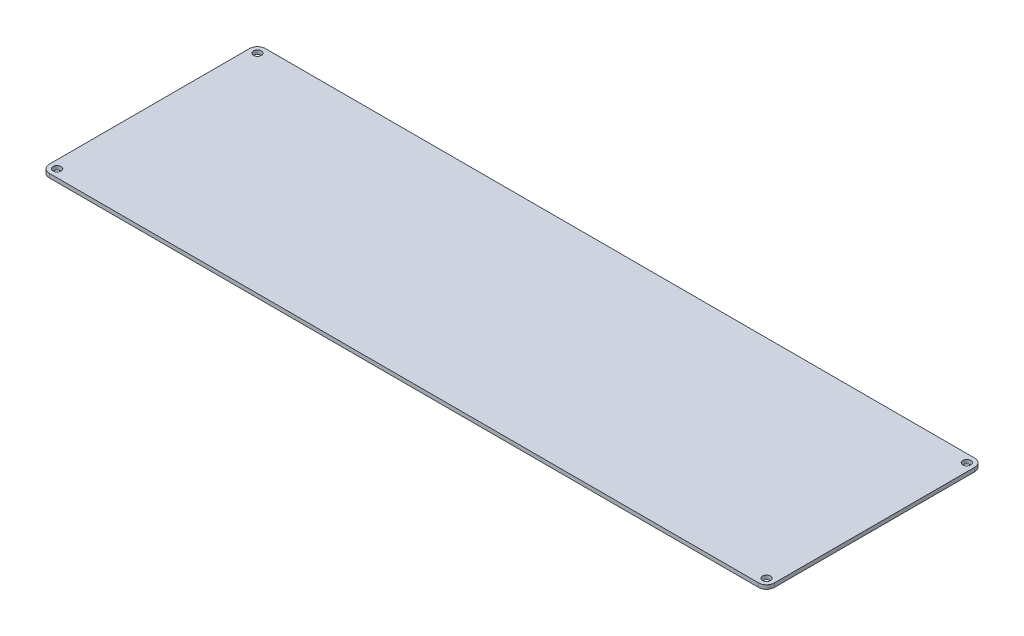
ISO-10303-21;
HEADER;
FILE_DESCRIPTION(('STEP AP214'),'2;1');
FILE_NAME('part.step','',(''),(''),'','','');
FILE_SCHEMA(('AUTOMOTIVE_DESIGN { 1 0 10303 214 1 1 1 1 }'));
ENDSEC;
DATA;
#1=APPLICATION_CONTEXT('core data for automotive mechanical design processes');
#2=APPLICATION_PROTOCOL_DEFINITION('international standard','automotive_design',2000,#1);
#3=PRODUCT_CONTEXT('',#1,'mechanical');
#4=PRODUCT('Part','Part','',(#3));
#5=PRODUCT_RELATED_PRODUCT_CATEGORY('part','',(#4));
#6=PRODUCT_DEFINITION_FORMATION('','',#4);
#7=PRODUCT_DEFINITION_CONTEXT('part definition',#1,'design');
#8=PRODUCT_DEFINITION('design','',#6,#7);
#9=PRODUCT_DEFINITION_SHAPE('','',#8);
#10=(LENGTH_UNIT() NAMED_UNIT(*) SI_UNIT(.MILLI.,.METRE.));
#11=(NAMED_UNIT(*) PLANE_ANGLE_UNIT() SI_UNIT($,.RADIAN.));
#12=(NAMED_UNIT(*) SI_UNIT($,.STERADIAN.) SOLID_ANGLE_UNIT());
#13=UNCERTAINTY_MEASURE_WITH_UNIT(LENGTH_MEASURE(1.E-05),#10,'distance_accuracy_value','');
#14=(GEOMETRIC_REPRESENTATION_CONTEXT(3) GLOBAL_UNCERTAINTY_ASSIGNED_CONTEXT((#13)) GLOBAL_UNIT_ASSIGNED_CONTEXT((#10,
#11,#12)) REPRESENTATION_CONTEXT('',''));
#15=CARTESIAN_POINT('',(0.,0.,0.));
#16=DIRECTION('',(0.,0.,1.));
#17=DIRECTION('',(1.,0.,0.));
#18=AXIS2_PLACEMENT_3D('',#15,#16,#17);
#19=CARTESIAN_POINT('',(333.951461861864,-3.175,0.));
#20=DIRECTION('',(-1.,0.,0.));
#21=DIRECTION('',(0.,0.,1.));
#22=AXIS2_PLACEMENT_3D('',#19,#20,#21);
#23=PLANE('',#22);
#24=DIRECTION('',(0.,0.,1.));
#25=VECTOR('',#24,1.);
#26=CARTESIAN_POINT('',(333.951461861864,0.,0.));
#27=LINE('',#26,#25);
#28=CARTESIAN_POINT('',(333.951461861864,0.,-192.647050824412));
#29=VERTEX_POINT('',#28);
#30=CARTESIAN_POINT('',(333.951461861864,0.,-31.8650508244125));
#31=VERTEX_POINT('',#30);
#32=EDGE_CURVE('E128',#29,#31,#27,.T.);
#33=ORIENTED_EDGE('',*,*,#32,.T.);
#34=DIRECTION('',(0.,1.,0.));
#35=VECTOR('',#34,1.);
#36=CARTESIAN_POINT('',(333.951461861864,-3.175,-31.8650508244125));
#37=LINE('',#36,#35);
#38=CARTESIAN_POINT('',(333.951461861864,-3.175,-31.8650508244125));
#39=VERTEX_POINT('',#38);
#40=EDGE_CURVE('E11',#31,#39,#37,.F.);
#41=ORIENTED_EDGE('',*,*,#40,.T.);
#42=DIRECTION('',(0.,0.,1.));
#43=VECTOR('',#42,1.);
#44=CARTESIAN_POINT('',(333.951461861864,-3.175,0.));
#45=LINE('',#44,#43);
#46=CARTESIAN_POINT('',(333.951461861864,-3.175,-192.647050824412));
#47=VERTEX_POINT('',#46);
#48=EDGE_CURVE('E164',#47,#39,#45,.T.);
#49=ORIENTED_EDGE('',*,*,#48,.F.);
#50=DIRECTION('',(0.,1.,0.));
#51=VECTOR('',#50,1.);
#52=CARTESIAN_POINT('',(333.951461861864,-3.175,-192.647050824412));
#53=LINE('',#52,#51);
#54=EDGE_CURVE('E43',#47,#29,#53,.T.);
#55=ORIENTED_EDGE('',*,*,#54,.T.);
#56=EDGE_LOOP('',(#33,#41,#49,#55));
#57=FACE_BOUND('',#56,.T.);
#58=ADVANCED_FACE('F35',(#57),#23,.F.);
#59=CARTESIAN_POINT('',(0.,-3.175,-25.5150508244125));
#60=DIRECTION('',(0.,0.,1.));
#61=DIRECTION('',(1.,0.,0.));
#62=AXIS2_PLACEMENT_3D('',#59,#60,#61);
#63=PLANE('',#62);
#64=DIRECTION('',(1.,0.,0.));
#65=VECTOR('',#64,1.);
#66=CARTESIAN_POINT('',(0.,0.,-25.5150508244125));
#67=LINE('',#66,#65);
#68=CARTESIAN_POINT('',(-241.858538510136,0.,-25.5150508244125));
#69=VERTEX_POINT('',#68);
#70=CARTESIAN_POINT('',(327.601461861864,0.,-25.5150508244125));
#71=VERTEX_POINT('',#70);
#72=EDGE_CURVE('E130',#69,#71,#67,.T.);
#73=ORIENTED_EDGE('',*,*,#72,.F.);
#74=DIRECTION('',(0.,1.,0.));
#75=VECTOR('',#74,1.);
#76=CARTESIAN_POINT('',(-241.858538510136,-3.175,-25.5150508244125));
#77=LINE('',#76,#75);
#78=CARTESIAN_POINT('',(-241.858538510136,-3.175,-25.5150508244125));
#79=VERTEX_POINT('',#78);
#80=EDGE_CURVE('E57',#69,#79,#77,.F.);
#81=ORIENTED_EDGE('',*,*,#80,.T.);
#82=DIRECTION('',(1.,0.,0.));
#83=VECTOR('',#82,1.);
#84=CARTESIAN_POINT('',(0.,-3.175,-25.5150508244125));
#85=LINE('',#84,#83);
#86=CARTESIAN_POINT('',(327.601461861864,-3.175,-25.5150508244125));
#87=VERTEX_POINT('',#86);
#88=EDGE_CURVE('E140',#79,#87,#85,.T.);
#89=ORIENTED_EDGE('',*,*,#88,.T.);
#90=DIRECTION('',(0.,1.,0.));
#91=VECTOR('',#90,1.);
#92=CARTESIAN_POINT('',(327.601461861864,0.,-25.5150508244125));
#93=LINE('',#92,#91);
#94=EDGE_CURVE('E156',#87,#71,#93,.T.);
#95=ORIENTED_EDGE('',*,*,#94,.T.);
#96=EDGE_LOOP('',(#73,#81,#89,#95));
#97=FACE_BOUND('',#96,.T.);
#98=ADVANCED_FACE('F170',(#97),#63,.T.);
#99=CARTESIAN_POINT('',(-248.208538510136,-3.175,0.));
#100=DIRECTION('',(-1.,0.,0.));
#101=DIRECTION('',(0.,0.,1.));
#102=AXIS2_PLACEMENT_3D('',#99,#100,#101);
#103=PLANE('',#102);
#104=DIRECTION('',(0.,0.,1.));
#105=VECTOR('',#104,1.);
#106=CARTESIAN_POINT('',(-248.208538510136,0.,0.));
#107=LINE('',#106,#105);
#108=CARTESIAN_POINT('',(-248.208538510136,0.,-192.647050824412));
#109=VERTEX_POINT('',#108);
#110=CARTESIAN_POINT('',(-248.208538510136,0.,-31.8650508244125));
#111=VERTEX_POINT('',#110);
#112=EDGE_CURVE('E127',#109,#111,#107,.T.);
#113=ORIENTED_EDGE('',*,*,#112,.F.);
#114=DIRECTION('',(0.,1.,0.));
#115=VECTOR('',#114,1.);
#116=CARTESIAN_POINT('',(-248.208538510136,-3.175,-192.647050824412));
#117=LINE('',#116,#115);
#118=CARTESIAN_POINT('',(-248.208538510136,-3.175,-192.647050824412));
#119=VERTEX_POINT('',#118);
#120=EDGE_CURVE('E106',#109,#119,#117,.F.);
#121=ORIENTED_EDGE('',*,*,#120,.T.);
#122=DIRECTION('',(0.,0.,1.));
#123=VECTOR('',#122,1.);
#124=CARTESIAN_POINT('',(-248.208538510136,-3.175,0.));
#125=LINE('',#124,#123);
#126=CARTESIAN_POINT('',(-248.208538510136,-3.175,-31.8650508244125));
#127=VERTEX_POINT('',#126);
#128=EDGE_CURVE('E172',#119,#127,#125,.T.);
#129=ORIENTED_EDGE('',*,*,#128,.T.);
#130=DIRECTION('',(0.,1.,0.));
#131=VECTOR('',#130,1.);
#132=CARTESIAN_POINT('',(-248.208538510136,-3.175,-31.8650508244125));
#133=LINE('',#132,#131);
#134=EDGE_CURVE('E111',#127,#111,#133,.T.);
#135=ORIENTED_EDGE('',*,*,#134,.T.);
#136=EDGE_LOOP('',(#113,#121,#129,#135));
#137=FACE_BOUND('',#136,.T.);
#138=ADVANCED_FACE('F211',(#137),#103,.T.);
#139=CARTESIAN_POINT('',(-241.858538510136,-3.175,-192.647050824412));
#140=DIRECTION('',(0.,1.,0.));
#141=DIRECTION('',(0.,0.,1.));
#142=AXIS2_PLACEMENT_3D('',#139,#140,#141);
#143=CYLINDRICAL_SURFACE('',#142,3.175);
#144=CARTESIAN_POINT('',(-241.858538510136,-3.175,-192.647050824412));
#145=DIRECTION('',(0.,1.,0.));
#146=DIRECTION('',(0.,0.,1.));
#147=AXIS2_PLACEMENT_3D('',#144,#145,#146);
#148=CIRCLE('',#147,3.175);
#149=CARTESIAN_POINT('',(-241.858538510136,-3.175,-189.472050824412));
#150=VERTEX_POINT('',#149);
#151=EDGE_CURVE('E239',#150,#150,#148,.T.);
#152=ORIENTED_EDGE('',*,*,#151,.F.);
#153=EDGE_LOOP('',(#152));
#154=FACE_BOUND('',#153,.T.);
#155=CARTESIAN_POINT('',(-241.858538510136,0.,-192.647050824412));
#156=DIRECTION('',(0.,1.,0.));
#157=DIRECTION('',(0.,0.,1.));
#158=AXIS2_PLACEMENT_3D('',#155,#156,#157);
#159=CIRCLE('',#158,3.175);
#160=CARTESIAN_POINT('',(-241.858538510136,0.,-189.472050824412));
#161=VERTEX_POINT('',#160);
#162=EDGE_CURVE('E133',#161,#161,#159,.T.);
#163=ORIENTED_EDGE('',*,*,#162,.T.);
#164=EDGE_LOOP('',(#163));
#165=FACE_BOUND('',#164,.T.);
#166=ADVANCED_FACE('F189',(#154,#165),#143,.F.);
#167=CARTESIAN_POINT('',(-241.858538510136,-3.175,-31.8650508244125));
#168=DIRECTION('',(0.,1.,0.));
#169=DIRECTION('',(0.,0.,1.));
#170=AXIS2_PLACEMENT_3D('',#167,#168,#169);
#171=CYLINDRICAL_SURFACE('',#170,3.17499999999997);
#172=CARTESIAN_POINT('',(-241.858538510136,-3.175,-31.8650508244125));
#173=DIRECTION('',(0.,1.,0.));
#174=DIRECTION('',(0.,0.,1.));
#175=AXIS2_PLACEMENT_3D('',#172,#173,#174);
#176=CIRCLE('',#175,3.17499999999997);
#177=CARTESIAN_POINT('',(-241.858538510136,-3.175,-28.6900508244125));
#178=VERTEX_POINT('',#177);
#179=EDGE_CURVE('E244',#178,#178,#176,.T.);
#180=ORIENTED_EDGE('',*,*,#179,.F.);
#181=EDGE_LOOP('',(#180));
#182=FACE_BOUND('',#181,.T.);
#183=CARTESIAN_POINT('',(-241.858538510136,0.,-31.8650508244125));
#184=DIRECTION('',(0.,1.,0.));
#185=DIRECTION('',(0.,0.,1.));
#186=AXIS2_PLACEMENT_3D('',#183,#184,#185);
#187=CIRCLE('',#186,3.17499999999997);
#188=CARTESIAN_POINT('',(-241.858538510136,0.,-28.6900508244125));
#189=VERTEX_POINT('',#188);
#190=EDGE_CURVE('E184',#189,#189,#187,.T.);
#191=ORIENTED_EDGE('',*,*,#190,.T.);
#192=EDGE_LOOP('',(#191));
#193=FACE_BOUND('',#192,.T.);
#194=ADVANCED_FACE('F217',(#182,#193),#171,.F.);
#195=CARTESIAN_POINT('',(327.601461861864,-3.175,-31.8650508244125));
#196=DIRECTION('',(0.,1.,0.));
#197=DIRECTION('',(0.,0.,1.));
#198=AXIS2_PLACEMENT_3D('',#195,#196,#197);
#199=CYLINDRICAL_SURFACE('',#198,3.17499999999997);
#200=CARTESIAN_POINT('',(327.601461861864,-3.175,-31.8650508244125));
#201=DIRECTION('',(0.,1.,0.));
#202=DIRECTION('',(0.,0.,1.));
#203=AXIS2_PLACEMENT_3D('',#200,#201,#202);
#204=CIRCLE('',#203,3.17499999999997);
#205=CARTESIAN_POINT('',(327.601461861864,-3.175,-28.6900508244125));
#206=VERTEX_POINT('',#205);
#207=EDGE_CURVE('E247',#206,#206,#204,.T.);
#208=ORIENTED_EDGE('',*,*,#207,.F.);
#209=EDGE_LOOP('',(#208));
#210=FACE_BOUND('',#209,.T.);
#211=CARTESIAN_POINT('',(327.601461861864,0.,-31.8650508244125));
#212=DIRECTION('',(0.,1.,0.));
#213=DIRECTION('',(0.,0.,1.));
#214=AXIS2_PLACEMENT_3D('',#211,#212,#213);
#215=CIRCLE('',#214,3.17499999999997);
#216=CARTESIAN_POINT('',(327.601461861864,0.,-28.6900508244125));
#217=VERTEX_POINT('',#216);
#218=EDGE_CURVE('E181',#217,#217,#215,.T.);
#219=ORIENTED_EDGE('',*,*,#218,.T.);
#220=EDGE_LOOP('',(#219));
#221=FACE_BOUND('',#220,.T.);
#222=ADVANCED_FACE('F221',(#210,#221),#199,.F.);
#223=CARTESIAN_POINT('',(327.601461861864,-3.175,-192.647050824412));
#224=DIRECTION('',(0.,1.,0.));
#225=DIRECTION('',(0.,0.,1.));
#226=AXIS2_PLACEMENT_3D('',#223,#224,#225);
#227=CYLINDRICAL_SURFACE('',#226,3.17499999999997);
#228=CARTESIAN_POINT('',(327.601461861864,-3.175,-192.647050824412));
#229=DIRECTION('',(0.,1.,0.));
#230=DIRECTION('',(0.,0.,1.));
#231=AXIS2_PLACEMENT_3D('',#228,#229,#230);
#232=CIRCLE('',#231,3.17499999999997);
#233=CARTESIAN_POINT('',(327.601461861864,-3.175,-189.472050824412));
#234=VERTEX_POINT('',#233);
#235=EDGE_CURVE('E139',#234,#234,#232,.T.);
#236=ORIENTED_EDGE('',*,*,#235,.F.);
#237=EDGE_LOOP('',(#236));
#238=FACE_BOUND('',#237,.T.);
#239=CARTESIAN_POINT('',(327.601461861864,0.,-192.647050824412));
#240=DIRECTION('',(0.,1.,0.));
#241=DIRECTION('',(0.,0.,1.));
#242=AXIS2_PLACEMENT_3D('',#239,#240,#241);
#243=CIRCLE('',#242,3.17499999999997);
#244=CARTESIAN_POINT('',(327.601461861864,0.,-189.472050824412));
#245=VERTEX_POINT('',#244);
#246=EDGE_CURVE('E178',#245,#245,#243,.T.);
#247=ORIENTED_EDGE('',*,*,#246,.T.);
#248=EDGE_LOOP('',(#247));
#249=FACE_BOUND('',#248,.T.);
#250=ADVANCED_FACE('F225',(#238,#249),#227,.F.);
#251=CARTESIAN_POINT('',(0.,-3.175,-198.997050824412));
#252=DIRECTION('',(0.,0.,1.));
#253=DIRECTION('',(1.,0.,0.));
#254=AXIS2_PLACEMENT_3D('',#251,#252,#253);
#255=PLANE('',#254);
#256=DIRECTION('',(1.,0.,0.));
#257=VECTOR('',#256,1.);
#258=CARTESIAN_POINT('',(0.,-3.175,-198.997050824412));
#259=LINE('',#258,#257);
#260=CARTESIAN_POINT('',(-241.858538510136,-3.175,-198.997050824412));
#261=VERTEX_POINT('',#260);
#262=CARTESIAN_POINT('',(327.601461861864,-3.175,-198.997050824412));
#263=VERTEX_POINT('',#262);
#264=EDGE_CURVE('E121',#261,#263,#259,.T.);
#265=ORIENTED_EDGE('',*,*,#264,.F.);
#266=DIRECTION('',(0.,1.,0.));
#267=VECTOR('',#266,1.);
#268=CARTESIAN_POINT('',(-241.858538510136,0.,-198.997050824412));
#269=LINE('',#268,#267);
#270=CARTESIAN_POINT('',(-241.858538510136,0.,-198.997050824412));
#271=VERTEX_POINT('',#270);
#272=EDGE_CURVE('E105',#261,#271,#269,.T.);
#273=ORIENTED_EDGE('',*,*,#272,.T.);
#274=DIRECTION('',(1.,0.,0.));
#275=VECTOR('',#274,1.);
#276=CARTESIAN_POINT('',(0.,0.,-198.997050824412));
#277=LINE('',#276,#275);
#278=CARTESIAN_POINT('',(327.601461861864,0.,-198.997050824412));
#279=VERTEX_POINT('',#278);
#280=EDGE_CURVE('E118',#271,#279,#277,.T.);
#281=ORIENTED_EDGE('',*,*,#280,.T.);
#282=DIRECTION('',(0.,1.,0.));
#283=VECTOR('',#282,1.);
#284=CARTESIAN_POINT('',(327.601461861864,-3.175,-198.997050824412));
#285=LINE('',#284,#283);
#286=EDGE_CURVE('E123',#279,#263,#285,.F.);
#287=ORIENTED_EDGE('',*,*,#286,.T.);
#288=EDGE_LOOP('',(#265,#273,#281,#287));
#289=FACE_BOUND('',#288,.T.);
#290=ADVANCED_FACE('F117',(#289),#255,.F.);
#291=CARTESIAN_POINT('',(0.,-3.175,0.));
#292=DIRECTION('',(0.,1.,0.));
#293=DIRECTION('',(0.,0.,1.));
#294=AXIS2_PLACEMENT_3D('',#291,#292,#293);
#295=PLANE('',#294);
#296=ORIENTED_EDGE('',*,*,#235,.T.);
#297=EDGE_LOOP('',(#296));
#298=FACE_BOUND('',#297,.T.);
#299=ORIENTED_EDGE('',*,*,#207,.T.);
#300=EDGE_LOOP('',(#299));
#301=FACE_BOUND('',#300,.T.);
#302=ORIENTED_EDGE('',*,*,#179,.T.);
#303=EDGE_LOOP('',(#302));
#304=FACE_BOUND('',#303,.T.);
#305=ORIENTED_EDGE('',*,*,#151,.T.);
#306=EDGE_LOOP('',(#305));
#307=FACE_BOUND('',#306,.T.);
#308=ORIENTED_EDGE('',*,*,#128,.F.);
#309=CARTESIAN_POINT('',(-241.858538510136,-3.175,-192.647050824412));
#310=DIRECTION('',(0.,1.,0.));
#311=DIRECTION('',(0.,0.,1.));
#312=AXIS2_PLACEMENT_3D('',#309,#310,#311);
#313=CIRCLE('',#312,6.35);
#314=EDGE_CURVE('E154',#119,#261,#313,.F.);
#315=ORIENTED_EDGE('',*,*,#314,.T.);
#316=ORIENTED_EDGE('',*,*,#264,.T.);
#317=CARTESIAN_POINT('',(327.601461861864,-3.175,-192.647050824412));
#318=DIRECTION('',(0.,1.,0.));
#319=DIRECTION('',(0.,0.,1.));
#320=AXIS2_PLACEMENT_3D('',#317,#318,#319);
#321=CIRCLE('',#320,6.35);
#322=EDGE_CURVE('E149',#263,#47,#321,.F.);
#323=ORIENTED_EDGE('',*,*,#322,.T.);
#324=ORIENTED_EDGE('',*,*,#48,.T.);
#325=CARTESIAN_POINT('',(327.601461861864,-3.175,-31.8650508244125));
#326=DIRECTION('',(0.,1.,0.));
#327=DIRECTION('',(0.,0.,1.));
#328=AXIS2_PLACEMENT_3D('',#325,#326,#327);
#329=CIRCLE('',#328,6.35);
#330=EDGE_CURVE('E50',#39,#87,#329,.F.);
#331=ORIENTED_EDGE('',*,*,#330,.T.);
#332=ORIENTED_EDGE('',*,*,#88,.F.);
#333=CARTESIAN_POINT('',(-241.858538510136,-3.175,-31.8650508244125));
#334=DIRECTION('',(0.,1.,0.));
#335=DIRECTION('',(0.,0.,1.));
#336=AXIS2_PLACEMENT_3D('',#333,#334,#335);
#337=CIRCLE('',#336,6.35);
#338=EDGE_CURVE('E152',#79,#127,#337,.F.);
#339=ORIENTED_EDGE('',*,*,#338,.T.);
#340=EDGE_LOOP('',(#308,#315,#316,#323,#324,#331,#332,#339));
#341=FACE_BOUND('',#340,.T.);
#342=ADVANCED_FACE('F192',(#298,#301,#304,#307,#341),#295,.F.);
#343=CARTESIAN_POINT('',(0.,0.,0.));
#344=DIRECTION('',(0.,1.,0.));
#345=DIRECTION('',(0.,0.,1.));
#346=AXIS2_PLACEMENT_3D('',#343,#344,#345);
#347=PLANE('',#346);
#348=ORIENTED_EDGE('',*,*,#246,.F.);
#349=EDGE_LOOP('',(#348));
#350=FACE_BOUND('',#349,.T.);
#351=ORIENTED_EDGE('',*,*,#218,.F.);
#352=EDGE_LOOP('',(#351));
#353=FACE_BOUND('',#352,.T.);
#354=ORIENTED_EDGE('',*,*,#190,.F.);
#355=EDGE_LOOP('',(#354));
#356=FACE_BOUND('',#355,.T.);
#357=ORIENTED_EDGE('',*,*,#162,.F.);
#358=EDGE_LOOP('',(#357));
#359=FACE_BOUND('',#358,.T.);
#360=ORIENTED_EDGE('',*,*,#280,.F.);
#361=CARTESIAN_POINT('',(-241.858538510136,0.,-192.647050824412));
#362=DIRECTION('',(0.,1.,0.));
#363=DIRECTION('',(0.,0.,1.));
#364=AXIS2_PLACEMENT_3D('',#361,#362,#363);
#365=CIRCLE('',#364,6.35);
#366=EDGE_CURVE('E101',#271,#109,#365,.T.);
#367=ORIENTED_EDGE('',*,*,#366,.T.);
#368=ORIENTED_EDGE('',*,*,#112,.T.);
#369=CARTESIAN_POINT('',(-241.858538510136,0.,-31.8650508244125));
#370=DIRECTION('',(0.,1.,0.));
#371=DIRECTION('',(0.,0.,1.));
#372=AXIS2_PLACEMENT_3D('',#369,#370,#371);
#373=CIRCLE('',#372,6.35);
#374=EDGE_CURVE('E112',#111,#69,#373,.T.);
#375=ORIENTED_EDGE('',*,*,#374,.T.);
#376=ORIENTED_EDGE('',*,*,#72,.T.);
#377=CARTESIAN_POINT('',(327.601461861864,0.,-31.8650508244125));
#378=DIRECTION('',(0.,1.,0.));
#379=DIRECTION('',(0.,0.,1.));
#380=AXIS2_PLACEMENT_3D('',#377,#378,#379);
#381=CIRCLE('',#380,6.35);
#382=EDGE_CURVE('E143',#71,#31,#381,.T.);
#383=ORIENTED_EDGE('',*,*,#382,.T.);
#384=ORIENTED_EDGE('',*,*,#32,.F.);
#385=CARTESIAN_POINT('',(327.601461861864,0.,-192.647050824412));
#386=DIRECTION('',(0.,1.,0.));
#387=DIRECTION('',(0.,0.,1.));
#388=AXIS2_PLACEMENT_3D('',#385,#386,#387);
#389=CIRCLE('',#388,6.35);
#390=EDGE_CURVE('E122',#29,#279,#389,.T.);
#391=ORIENTED_EDGE('',*,*,#390,.T.);
#392=EDGE_LOOP('',(#360,#367,#368,#375,#376,#383,#384,#391));
#393=FACE_BOUND('',#392,.T.);
#394=ADVANCED_FACE('F125',(#350,#353,#356,#359,#393),#347,.T.);
#395=CARTESIAN_POINT('',(-241.858538510136,-3.175,-192.647050824412));
#396=DIRECTION('',(0.,-1.,0.));
#397=DIRECTION('',(0.,0.,-1.));
#398=AXIS2_PLACEMENT_3D('',#395,#396,#397);
#399=CYLINDRICAL_SURFACE('',#398,6.35);
#400=ORIENTED_EDGE('',*,*,#314,.F.);
#401=ORIENTED_EDGE('',*,*,#120,.F.);
#402=ORIENTED_EDGE('',*,*,#366,.F.);
#403=ORIENTED_EDGE('',*,*,#272,.F.);
#404=EDGE_LOOP('',(#400,#401,#402,#403));
#405=FACE_BOUND('',#404,.T.);
#406=ADVANCED_FACE('F104',(#405),#399,.T.);
#407=CARTESIAN_POINT('',(-241.858538510136,-3.175,-31.8650508244125));
#408=DIRECTION('',(0.,1.,0.));
#409=DIRECTION('',(0.,0.,1.));
#410=AXIS2_PLACEMENT_3D('',#407,#408,#409);
#411=CYLINDRICAL_SURFACE('',#410,6.35);
#412=ORIENTED_EDGE('',*,*,#338,.F.);
#413=ORIENTED_EDGE('',*,*,#80,.F.);
#414=ORIENTED_EDGE('',*,*,#374,.F.);
#415=ORIENTED_EDGE('',*,*,#134,.F.);
#416=EDGE_LOOP('',(#412,#413,#414,#415));
#417=FACE_BOUND('',#416,.T.);
#418=ADVANCED_FACE('F199',(#417),#411,.T.);
#419=CARTESIAN_POINT('',(327.601461861864,-3.175,-31.8650508244125));
#420=DIRECTION('',(0.,-1.,0.));
#421=DIRECTION('',(0.,0.,-1.));
#422=AXIS2_PLACEMENT_3D('',#419,#420,#421);
#423=CYLINDRICAL_SURFACE('',#422,6.35);
#424=ORIENTED_EDGE('',*,*,#330,.F.);
#425=ORIENTED_EDGE('',*,*,#40,.F.);
#426=ORIENTED_EDGE('',*,*,#382,.F.);
#427=ORIENTED_EDGE('',*,*,#94,.F.);
#428=EDGE_LOOP('',(#424,#425,#426,#427));
#429=FACE_BOUND('',#428,.T.);
#430=ADVANCED_FACE('F169',(#429),#423,.T.);
#431=CARTESIAN_POINT('',(327.601461861864,-3.175,-192.647050824412));
#432=DIRECTION('',(0.,1.,0.));
#433=DIRECTION('',(0.,0.,1.));
#434=AXIS2_PLACEMENT_3D('',#431,#432,#433);
#435=CYLINDRICAL_SURFACE('',#434,6.35);
#436=ORIENTED_EDGE('',*,*,#322,.F.);
#437=ORIENTED_EDGE('',*,*,#286,.F.);
#438=ORIENTED_EDGE('',*,*,#390,.F.);
#439=ORIENTED_EDGE('',*,*,#54,.F.);
#440=EDGE_LOOP('',(#436,#437,#438,#439));
#441=FACE_BOUND('',#440,.T.);
#442=ADVANCED_FACE('F37',(#441),#435,.T.);
#443=CLOSED_SHELL('',(#58,#98,#138,#166,#194,#222,#250,#290,#342,#394,#406,#418,#430,#442));
#444=MANIFOLD_SOLID_BREP('B2',#443);
#445=ADVANCED_BREP_SHAPE_REPRESENTATION('',(#18,#444),#14);
#446=SHAPE_DEFINITION_REPRESENTATION(#9,#445);
ENDSEC;
END-ISO-10303-21;
